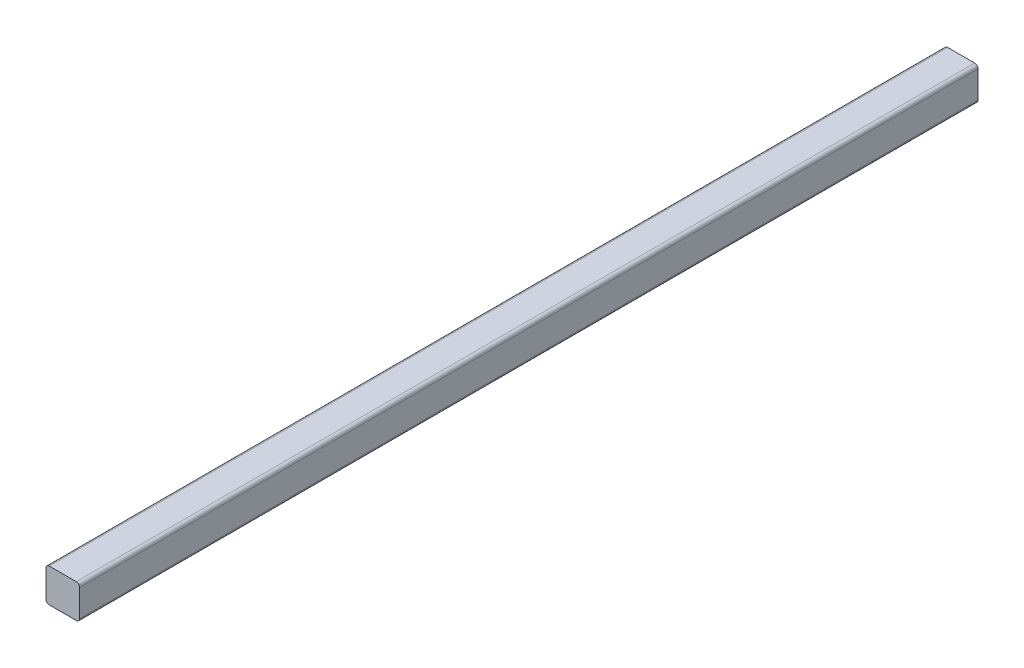
ISO-10303-21;
HEADER;
FILE_DESCRIPTION(('STEP AP214'),'2;1');
FILE_NAME('part.step','',(''),(''),'','','');
FILE_SCHEMA(('AUTOMOTIVE_DESIGN { 1 0 10303 214 1 1 1 1 }'));
ENDSEC;
DATA;
#1=APPLICATION_CONTEXT('core data for automotive mechanical design processes');
#2=APPLICATION_PROTOCOL_DEFINITION('international standard','automotive_design',2000,#1);
#3=PRODUCT_CONTEXT('',#1,'mechanical');
#4=PRODUCT('Part','Part','',(#3));
#5=PRODUCT_RELATED_PRODUCT_CATEGORY('part','',(#4));
#6=PRODUCT_DEFINITION_FORMATION('','',#4);
#7=PRODUCT_DEFINITION_CONTEXT('part definition',#1,'design');
#8=PRODUCT_DEFINITION('design','',#6,#7);
#9=PRODUCT_DEFINITION_SHAPE('','',#8);
#10=(LENGTH_UNIT() NAMED_UNIT(*) SI_UNIT(.MILLI.,.METRE.));
#11=(NAMED_UNIT(*) PLANE_ANGLE_UNIT() SI_UNIT($,.RADIAN.));
#12=(NAMED_UNIT(*) SI_UNIT($,.STERADIAN.) SOLID_ANGLE_UNIT());
#13=UNCERTAINTY_MEASURE_WITH_UNIT(LENGTH_MEASURE(1.E-05),#10,'distance_accuracy_value','');
#14=(GEOMETRIC_REPRESENTATION_CONTEXT(3) GLOBAL_UNCERTAINTY_ASSIGNED_CONTEXT((#13)) GLOBAL_UNIT_ASSIGNED_CONTEXT((#10,
#11,#12)) REPRESENTATION_CONTEXT('',''));
#15=CARTESIAN_POINT('',(0.,0.,0.));
#16=DIRECTION('',(0.,0.,1.));
#17=DIRECTION('',(1.,0.,0.));
#18=AXIS2_PLACEMENT_3D('',#15,#16,#17);
#19=CARTESIAN_POINT('',(280.580773414231,-10.0000000000068,-99.500000000028));
#20=DIRECTION('',(1.,0.,0.));
#21=DIRECTION('',(0.,0.,-1.));
#22=AXIS2_PLACEMENT_3D('',#19,#20,#21);
#23=PLANE('',#22);
#24=DIRECTION('',(0.,0.,-1.));
#25=VECTOR('',#24,1.);
#26=CARTESIAN_POINT('',(280.580773414231,-37.0000000000072,-99.500000000028));
#27=LINE('',#26,#25);
#28=CARTESIAN_POINT('',(280.580773414165,-37.0000000000072,-899.500000000028));
#29=VERTEX_POINT('',#28);
#30=CARTESIAN_POINT('',(280.580773414231,-37.0000000000072,-99.500000000028));
#31=VERTEX_POINT('',#30);
#32=EDGE_CURVE('E134',#29,#31,#27,.F.);
#33=ORIENTED_EDGE('',*,*,#32,.F.);
#34=DIRECTION('',(0.,1.,0.));
#35=VECTOR('',#34,1.);
#36=CARTESIAN_POINT('',(280.580773414165,-25.0000000000037,-899.500000000028));
#37=LINE('',#36,#35);
#38=CARTESIAN_POINT('',(280.580773414165,-13.0000000000068,-899.500000000028));
#39=VERTEX_POINT('',#38);
#40=EDGE_CURVE('E92',#39,#29,#37,.F.);
#41=ORIENTED_EDGE('',*,*,#40,.F.);
#42=DIRECTION('',(0.,0.,-1.));
#43=VECTOR('',#42,1.);
#44=CARTESIAN_POINT('',(280.580773414231,-13.0000000000068,-99.500000000028));
#45=LINE('',#44,#43);
#46=CARTESIAN_POINT('',(280.580773414231,-13.0000000000068,-99.500000000028));
#47=VERTEX_POINT('',#46);
#48=EDGE_CURVE('E87',#47,#39,#45,.T.);
#49=ORIENTED_EDGE('',*,*,#48,.F.);
#50=DIRECTION('',(0.,1.,0.));
#51=VECTOR('',#50,1.);
#52=CARTESIAN_POINT('',(280.580773414231,-25.0000000000037,-99.500000000028));
#53=LINE('',#52,#51);
#54=EDGE_CURVE('E89',#47,#31,#53,.F.);
#55=ORIENTED_EDGE('',*,*,#54,.T.);
#56=EDGE_LOOP('',(#33,#41,#49,#55));
#57=FACE_BOUND('',#56,.T.);
#58=ADVANCED_FACE('F17',(#57),#23,.T.);
#59=CARTESIAN_POINT('',(277.580773414231,-37.0000000000072,-99.5000000000278));
#60=DIRECTION('',(0.,0.,-1.));
#61=DIRECTION('',(-1.,0.,0.));
#62=AXIS2_PLACEMENT_3D('',#59,#60,#61);
#63=CYLINDRICAL_SURFACE('',#62,3.);
#64=CARTESIAN_POINT('',(277.580773414231,-37.0000000000072,-99.5000000000278));
#65=DIRECTION('',(0.,0.,-1.));
#66=DIRECTION('',(-1.,0.,0.));
#67=AXIS2_PLACEMENT_3D('',#64,#65,#66);
#68=CIRCLE('',#67,3.);
#69=CARTESIAN_POINT('',(277.580773414198,-40.0000000000072,-99.5000000000278));
#70=VERTEX_POINT('',#69);
#71=EDGE_CURVE('E102',#31,#70,#68,.T.);
#72=ORIENTED_EDGE('',*,*,#71,.T.);
#73=DIRECTION('',(0.,0.,-1.));
#74=VECTOR('',#73,1.);
#75=CARTESIAN_POINT('',(277.580773414165,-40.0000000000072,-99.500000000028));
#76=LINE('',#75,#74);
#77=CARTESIAN_POINT('',(277.580773414165,-40.0000000000072,-899.500000000028));
#78=VERTEX_POINT('',#77);
#79=EDGE_CURVE('E131',#78,#70,#76,.F.);
#80=ORIENTED_EDGE('',*,*,#79,.F.);
#81=CARTESIAN_POINT('',(277.580773414165,-37.0000000000072,-899.500000000028));
#82=DIRECTION('',(0.,0.,-1.));
#83=DIRECTION('',(-1.,0.,0.));
#84=AXIS2_PLACEMENT_3D('',#81,#82,#83);
#85=CIRCLE('',#84,3.);
#86=EDGE_CURVE('E124',#29,#78,#85,.T.);
#87=ORIENTED_EDGE('',*,*,#86,.F.);
#88=ORIENTED_EDGE('',*,*,#32,.T.);
#89=EDGE_LOOP('',(#72,#80,#87,#88));
#90=FACE_BOUND('',#89,.T.);
#91=ADVANCED_FACE('F149',(#90),#63,.T.);
#92=CARTESIAN_POINT('',(280.580773414231,-40.0000000000072,-99.500000000028));
#93=DIRECTION('',(0.,-1.,0.));
#94=DIRECTION('',(0.,0.,-1.));
#95=AXIS2_PLACEMENT_3D('',#92,#93,#94);
#96=PLANE('',#95);
#97=DIRECTION('',(0.,0.,-1.));
#98=VECTOR('',#97,1.);
#99=CARTESIAN_POINT('',(253.580773414231,-40.0000000000072,-99.5000000000258));
#100=LINE('',#99,#98);
#101=CARTESIAN_POINT('',(253.580773414165,-40.0000000000072,-899.500000000026));
#102=VERTEX_POINT('',#101);
#103=CARTESIAN_POINT('',(253.580773414231,-40.0000000000072,-99.5000000000258));
#104=VERTEX_POINT('',#103);
#105=EDGE_CURVE('E128',#102,#104,#100,.F.);
#106=ORIENTED_EDGE('',*,*,#105,.F.);
#107=DIRECTION('',(-1.,0.,0.));
#108=VECTOR('',#107,1.);
#109=CARTESIAN_POINT('',(0.580773414165114,-40.0000000000072,-899.500000000005));
#110=LINE('',#109,#108);
#111=EDGE_CURVE('E121',#78,#102,#110,.T.);
#112=ORIENTED_EDGE('',*,*,#111,.F.);
#113=ORIENTED_EDGE('',*,*,#79,.T.);
#114=DIRECTION('',(-1.,0.,0.));
#115=VECTOR('',#114,1.);
#116=CARTESIAN_POINT('',(0.58077341423146,-40.0000000000072,-99.5000000000048));
#117=LINE('',#116,#115);
#118=EDGE_CURVE('E105',#70,#104,#117,.T.);
#119=ORIENTED_EDGE('',*,*,#118,.T.);
#120=EDGE_LOOP('',(#106,#112,#113,#119));
#121=FACE_BOUND('',#120,.T.);
#122=ADVANCED_FACE('F151',(#121),#96,.T.);
#123=CARTESIAN_POINT('',(253.580773414231,-37.0000000000072,-99.5000000000258));
#124=DIRECTION('',(0.,0.,-1.));
#125=DIRECTION('',(-1.,0.,0.));
#126=AXIS2_PLACEMENT_3D('',#123,#124,#125);
#127=CYLINDRICAL_SURFACE('',#126,3.);
#128=CARTESIAN_POINT('',(253.580773414231,-37.0000000000072,-99.5000000000258));
#129=DIRECTION('',(0.,0.,-1.));
#130=DIRECTION('',(-1.,0.,0.));
#131=AXIS2_PLACEMENT_3D('',#128,#129,#130);
#132=CIRCLE('',#131,3.);
#133=CARTESIAN_POINT('',(250.580773414231,-37.0000000000072,-99.5000000000255));
#134=VERTEX_POINT('',#133);
#135=EDGE_CURVE('E138',#104,#134,#132,.T.);
#136=ORIENTED_EDGE('',*,*,#135,.T.);
#137=DIRECTION('',(0.,0.,1.));
#138=VECTOR('',#137,1.);
#139=CARTESIAN_POINT('',(250.580773414231,-37.0000000000072,-99.5000000000255));
#140=LINE('',#139,#138);
#141=CARTESIAN_POINT('',(250.580773414165,-37.0000000000072,-899.500000000026));
#142=VERTEX_POINT('',#141);
#143=EDGE_CURVE('E93',#142,#134,#140,.T.);
#144=ORIENTED_EDGE('',*,*,#143,.F.);
#145=CARTESIAN_POINT('',(253.580773414165,-37.0000000000072,-899.500000000026));
#146=DIRECTION('',(0.,0.,-1.));
#147=DIRECTION('',(-1.,0.,0.));
#148=AXIS2_PLACEMENT_3D('',#145,#146,#147);
#149=CIRCLE('',#148,3.);
#150=EDGE_CURVE('E120',#102,#142,#149,.T.);
#151=ORIENTED_EDGE('',*,*,#150,.F.);
#152=ORIENTED_EDGE('',*,*,#105,.T.);
#153=EDGE_LOOP('',(#136,#144,#151,#152));
#154=FACE_BOUND('',#153,.T.);
#155=ADVANCED_FACE('F155',(#154),#127,.T.);
#156=CARTESIAN_POINT('',(250.580773414231,-40.0000000000072,-99.5000000000255));
#157=DIRECTION('',(-1.,0.,0.));
#158=DIRECTION('',(0.,0.,1.));
#159=AXIS2_PLACEMENT_3D('',#156,#157,#158);
#160=PLANE('',#159);
#161=DIRECTION('',(0.,0.,-1.));
#162=VECTOR('',#161,1.);
#163=CARTESIAN_POINT('',(250.580773414231,-13.0000000000068,-99.5000000000256));
#164=LINE('',#163,#162);
#165=CARTESIAN_POINT('',(250.580773414165,-13.0000000000068,-899.500000000026));
#166=VERTEX_POINT('',#165);
#167=CARTESIAN_POINT('',(250.580773414231,-13.0000000000068,-99.5000000000255));
#168=VERTEX_POINT('',#167);
#169=EDGE_CURVE('E103',#166,#168,#164,.F.);
#170=ORIENTED_EDGE('',*,*,#169,.F.);
#171=DIRECTION('',(0.,1.,0.));
#172=VECTOR('',#171,1.);
#173=CARTESIAN_POINT('',(250.580773414165,-25.0000000000037,-899.500000000026));
#174=LINE('',#173,#172);
#175=EDGE_CURVE('E118',#142,#166,#174,.T.);
#176=ORIENTED_EDGE('',*,*,#175,.F.);
#177=ORIENTED_EDGE('',*,*,#143,.T.);
#178=DIRECTION('',(0.,1.,0.));
#179=VECTOR('',#178,1.);
#180=CARTESIAN_POINT('',(250.580773414231,-25.0000000000037,-99.5000000000255));
#181=LINE('',#180,#179);
#182=EDGE_CURVE('E137',#134,#168,#181,.T.);
#183=ORIENTED_EDGE('',*,*,#182,.T.);
#184=EDGE_LOOP('',(#170,#176,#177,#183));
#185=FACE_BOUND('',#184,.T.);
#186=ADVANCED_FACE('F159',(#185),#160,.T.);
#187=CARTESIAN_POINT('',(277.580773414231,-13.0000000000068,-99.5000000000278));
#188=DIRECTION('',(0.,0.,-1.));
#189=DIRECTION('',(-1.,0.,0.));
#190=AXIS2_PLACEMENT_3D('',#187,#188,#189);
#191=CYLINDRICAL_SURFACE('',#190,3.);
#192=CARTESIAN_POINT('',(277.580773414231,-13.0000000000068,-99.5000000000278));
#193=DIRECTION('',(0.,0.,-1.));
#194=DIRECTION('',(-1.,0.,0.));
#195=AXIS2_PLACEMENT_3D('',#192,#193,#194);
#196=CIRCLE('',#195,3.);
#197=CARTESIAN_POINT('',(277.580773414231,-10.0000000000068,-99.5000000000268));
#198=VERTEX_POINT('',#197);
#199=EDGE_CURVE('E95',#198,#47,#196,.T.);
#200=ORIENTED_EDGE('',*,*,#199,.T.);
#201=ORIENTED_EDGE('',*,*,#48,.T.);
#202=CARTESIAN_POINT('',(277.580773414165,-13.0000000000068,-899.500000000028));
#203=DIRECTION('',(0.,0.,-1.));
#204=DIRECTION('',(-1.,0.,0.));
#205=AXIS2_PLACEMENT_3D('',#202,#203,#204);
#206=CIRCLE('',#205,3.);
#207=CARTESIAN_POINT('',(277.580773414198,-10.0000000000068,-899.500000000028));
#208=VERTEX_POINT('',#207);
#209=EDGE_CURVE('E20',#208,#39,#206,.T.);
#210=ORIENTED_EDGE('',*,*,#209,.F.);
#211=DIRECTION('',(0.,0.,1.));
#212=VECTOR('',#211,1.);
#213=CARTESIAN_POINT('',(277.580773414231,-10.0000000000068,-99.5000000000255));
#214=LINE('',#213,#212);
#215=EDGE_CURVE('E81',#198,#208,#214,.F.);
#216=ORIENTED_EDGE('',*,*,#215,.F.);
#217=EDGE_LOOP('',(#200,#201,#210,#216));
#218=FACE_BOUND('',#217,.T.);
#219=ADVANCED_FACE('F96',(#218),#191,.T.);
#220=CARTESIAN_POINT('',(0.580773414165114,-25.0000000000037,-899.500000000005));
#221=DIRECTION('',(0.,0.,-1.));
#222=DIRECTION('',(-1.,0.,0.));
#223=AXIS2_PLACEMENT_3D('',#220,#221,#222);
#224=PLANE('',#223);
#225=CARTESIAN_POINT('',(253.580773414165,-13.0000000000068,-899.500000000026));
#226=DIRECTION('',(0.,0.,-1.));
#227=DIRECTION('',(-1.,0.,0.));
#228=AXIS2_PLACEMENT_3D('',#225,#226,#227);
#229=CIRCLE('',#228,3.);
#230=CARTESIAN_POINT('',(253.580773414165,-10.0000000000068,-899.500000000027));
#231=VERTEX_POINT('',#230);
#232=EDGE_CURVE('E107',#231,#166,#229,.F.);
#233=ORIENTED_EDGE('',*,*,#232,.F.);
#234=DIRECTION('',(1.,0.,0.));
#235=VECTOR('',#234,1.);
#236=CARTESIAN_POINT('',(250.580773414231,-10.0000000000068,-899.500000000028));
#237=LINE('',#236,#235);
#238=EDGE_CURVE('E113',#208,#231,#237,.F.);
#239=ORIENTED_EDGE('',*,*,#238,.F.);
#240=ORIENTED_EDGE('',*,*,#209,.T.);
#241=ORIENTED_EDGE('',*,*,#40,.T.);
#242=ORIENTED_EDGE('',*,*,#86,.T.);
#243=ORIENTED_EDGE('',*,*,#111,.T.);
#244=ORIENTED_EDGE('',*,*,#150,.T.);
#245=ORIENTED_EDGE('',*,*,#175,.T.);
#246=EDGE_LOOP('',(#233,#239,#240,#241,#242,#243,#244,#245));
#247=FACE_BOUND('',#246,.T.);
#248=ADVANCED_FACE('F146',(#247),#224,.T.);
#249=CARTESIAN_POINT('',(253.580773414231,-13.0000000000068,-99.5000000000258));
#250=DIRECTION('',(0.,0.,-1.));
#251=DIRECTION('',(-1.,0.,0.));
#252=AXIS2_PLACEMENT_3D('',#249,#250,#251);
#253=CYLINDRICAL_SURFACE('',#252,3.);
#254=CARTESIAN_POINT('',(253.580773414231,-13.0000000000068,-99.5000000000258));
#255=DIRECTION('',(0.,0.,-1.));
#256=DIRECTION('',(-1.,0.,0.));
#257=AXIS2_PLACEMENT_3D('',#254,#255,#256);
#258=CIRCLE('',#257,3.);
#259=CARTESIAN_POINT('',(253.580773414198,-10.0000000000068,-99.5000000000258));
#260=VERTEX_POINT('',#259);
#261=EDGE_CURVE('E35',#168,#260,#258,.T.);
#262=ORIENTED_EDGE('',*,*,#261,.T.);
#263=DIRECTION('',(0.,0.,1.));
#264=VECTOR('',#263,1.);
#265=CARTESIAN_POINT('',(253.580773414165,-10.0000000000068,-99.5000000000255));
#266=LINE('',#265,#264);
#267=EDGE_CURVE('E26',#231,#260,#266,.T.);
#268=ORIENTED_EDGE('',*,*,#267,.F.);
#269=ORIENTED_EDGE('',*,*,#232,.T.);
#270=ORIENTED_EDGE('',*,*,#169,.T.);
#271=EDGE_LOOP('',(#262,#268,#269,#270));
#272=FACE_BOUND('',#271,.T.);
#273=ADVANCED_FACE('F161',(#272),#253,.T.);
#274=CARTESIAN_POINT('',(0.58077341423146,-25.0000000000037,-99.5000000000048));
#275=DIRECTION('',(0.,0.,-1.));
#276=DIRECTION('',(-1.,0.,0.));
#277=AXIS2_PLACEMENT_3D('',#274,#275,#276);
#278=PLANE('',#277);
#279=DIRECTION('',(1.,0.,0.));
#280=VECTOR('',#279,1.);
#281=CARTESIAN_POINT('',(250.580773414231,-10.0000000000068,-99.5000000000258));
#282=LINE('',#281,#280);
#283=EDGE_CURVE('E11',#260,#198,#282,.T.);
#284=ORIENTED_EDGE('',*,*,#283,.F.);
#285=ORIENTED_EDGE('',*,*,#261,.F.);
#286=ORIENTED_EDGE('',*,*,#182,.F.);
#287=ORIENTED_EDGE('',*,*,#135,.F.);
#288=ORIENTED_EDGE('',*,*,#118,.F.);
#289=ORIENTED_EDGE('',*,*,#71,.F.);
#290=ORIENTED_EDGE('',*,*,#54,.F.);
#291=ORIENTED_EDGE('',*,*,#199,.F.);
#292=EDGE_LOOP('',(#284,#285,#286,#287,#288,#289,#290,#291));
#293=FACE_BOUND('',#292,.T.);
#294=ADVANCED_FACE('F100',(#293),#278,.F.);
#295=CARTESIAN_POINT('',(250.580773414231,-10.0000000000068,-99.5000000000255));
#296=DIRECTION('',(0.,1.,0.));
#297=DIRECTION('',(0.,0.,1.));
#298=AXIS2_PLACEMENT_3D('',#295,#296,#297);
#299=PLANE('',#298);
#300=ORIENTED_EDGE('',*,*,#267,.T.);
#301=ORIENTED_EDGE('',*,*,#283,.T.);
#302=ORIENTED_EDGE('',*,*,#215,.T.);
#303=ORIENTED_EDGE('',*,*,#238,.T.);
#304=EDGE_LOOP('',(#300,#301,#302,#303));
#305=FACE_BOUND('',#304,.T.);
#306=ADVANCED_FACE('F163',(#305),#299,.T.);
#307=CLOSED_SHELL('',(#58,#91,#122,#155,#186,#219,#248,#273,#294,#306));
#308=MANIFOLD_SOLID_BREP('B1',#307);
#309=ADVANCED_BREP_SHAPE_REPRESENTATION('',(#18,#308),#14);
#310=SHAPE_DEFINITION_REPRESENTATION(#9,#309);
ENDSEC;
END-ISO-10303-21;
